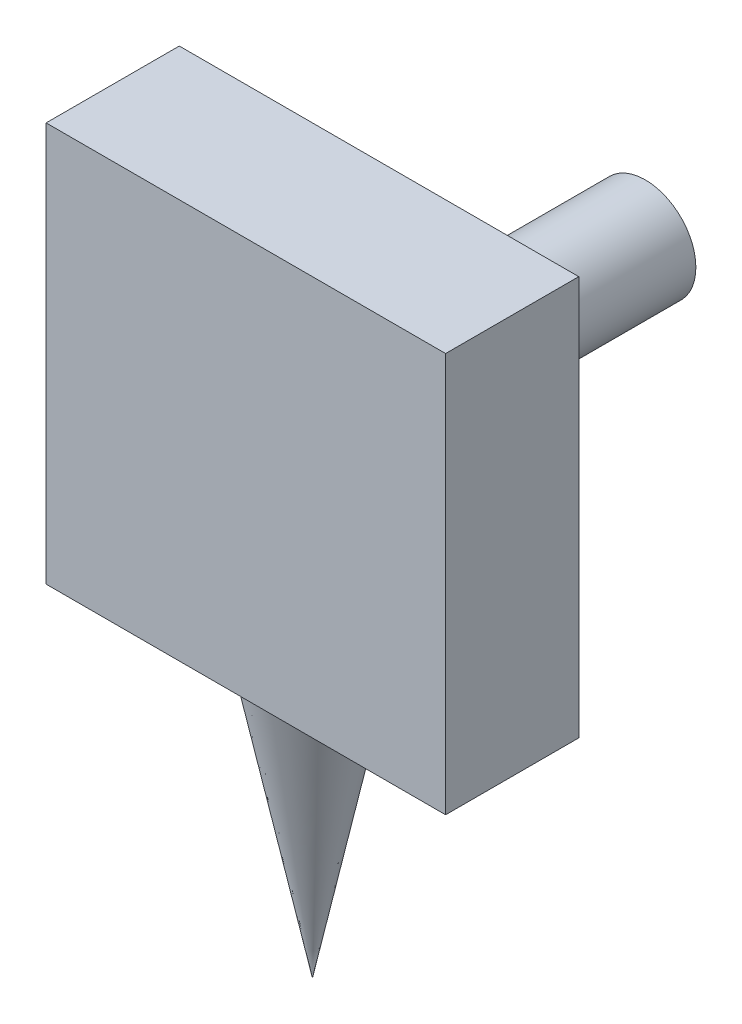
ISO-10303-21;
HEADER;
FILE_DESCRIPTION(('STEP AP214'),'2;1');
FILE_NAME('part.step','',(''),(''),'','','');
FILE_SCHEMA(('AUTOMOTIVE_DESIGN { 1 0 10303 214 1 1 1 1 }'));
ENDSEC;
DATA;
#1=APPLICATION_CONTEXT('core data for automotive mechanical design processes');
#2=APPLICATION_PROTOCOL_DEFINITION('international standard','automotive_design',2000,#1);
#3=PRODUCT_CONTEXT('',#1,'mechanical');
#4=PRODUCT('Part','Part','',(#3));
#5=PRODUCT_RELATED_PRODUCT_CATEGORY('part','',(#4));
#6=PRODUCT_DEFINITION_FORMATION('','',#4);
#7=PRODUCT_DEFINITION_CONTEXT('part definition',#1,'design');
#8=PRODUCT_DEFINITION('design','',#6,#7);
#9=PRODUCT_DEFINITION_SHAPE('','',#8);
#10=(LENGTH_UNIT() NAMED_UNIT(*) SI_UNIT(.MILLI.,.METRE.));
#11=(NAMED_UNIT(*) PLANE_ANGLE_UNIT() SI_UNIT($,.RADIAN.));
#12=(NAMED_UNIT(*) SI_UNIT($,.STERADIAN.) SOLID_ANGLE_UNIT());
#13=UNCERTAINTY_MEASURE_WITH_UNIT(LENGTH_MEASURE(1.E-05),#10,'distance_accuracy_value','');
#14=(GEOMETRIC_REPRESENTATION_CONTEXT(3) GLOBAL_UNCERTAINTY_ASSIGNED_CONTEXT((#13)) GLOBAL_UNIT_ASSIGNED_CONTEXT((#10,
#11,#12)) REPRESENTATION_CONTEXT('',''));
#15=CARTESIAN_POINT('',(0.,0.,0.));
#16=DIRECTION('',(0.,0.,1.));
#17=DIRECTION('',(1.,0.,0.));
#18=AXIS2_PLACEMENT_3D('',#15,#16,#17);
#19=CARTESIAN_POINT('',(126.972995010655,125.730606970893,-20.));
#20=DIRECTION('',(0.,0.,1.));
#21=DIRECTION('',(1.,0.,0.));
#22=AXIS2_PLACEMENT_3D('',#19,#20,#21);
#23=CYLINDRICAL_SURFACE('',#22,3.79500000000002);
#24=CARTESIAN_POINT('',(126.972995010655,125.730606970893,-20.));
#25=DIRECTION('',(0.,0.,1.));
#26=DIRECTION('',(1.,0.,0.));
#27=AXIS2_PLACEMENT_3D('',#24,#25,#26);
#28=CIRCLE('',#27,3.79500000000002);
#29=CARTESIAN_POINT('',(130.767995010655,125.730606970893,-20.));
#30=VERTEX_POINT('',#29);
#31=EDGE_CURVE('E11',#30,#30,#28,.T.);
#32=ORIENTED_EDGE('',*,*,#31,.T.);
#33=EDGE_LOOP('',(#32));
#34=FACE_BOUND('',#33,.T.);
#35=CARTESIAN_POINT('',(126.972995010655,125.730606970893,0.));
#36=DIRECTION('',(0.,0.,1.));
#37=DIRECTION('',(1.,0.,0.));
#38=AXIS2_PLACEMENT_3D('',#35,#36,#37);
#39=CIRCLE('',#38,3.79500000000002);
#40=CARTESIAN_POINT('',(130.767995010655,125.730606970893,0.));
#41=VERTEX_POINT('',#40);
#42=EDGE_CURVE('E35',#41,#41,#39,.T.);
#43=ORIENTED_EDGE('',*,*,#42,.F.);
#44=EDGE_LOOP('',(#43));
#45=FACE_BOUND('',#44,.T.);
#46=ADVANCED_FACE('F32',(#34,#45),#23,.T.);
#47=CARTESIAN_POINT('',(126.972995010655,125.730606970893,-20.));
#48=DIRECTION('',(0.,0.,1.));
#49=DIRECTION('',(1.,0.,0.));
#50=AXIS2_PLACEMENT_3D('',#47,#48,#49);
#51=PLANE('',#50);
#52=ORIENTED_EDGE('',*,*,#31,.F.);
#53=EDGE_LOOP('',(#52));
#54=FACE_BOUND('',#53,.T.);
#55=ADVANCED_FACE('F98',(#54),#51,.F.);
#56=CARTESIAN_POINT('',(141.972995010655,110.730606970893,10.));
#57=DIRECTION('',(-1.,0.,0.));
#58=DIRECTION('',(0.,0.,1.));
#59=AXIS2_PLACEMENT_3D('',#56,#57,#58);
#60=PLANE('',#59);
#61=DIRECTION('',(0.,1.,0.));
#62=VECTOR('',#61,1.);
#63=CARTESIAN_POINT('',(141.972995010655,110.730606970893,0.));
#64=LINE('',#63,#62);
#65=CARTESIAN_POINT('',(141.972995010655,110.730606970893,0.));
#66=VERTEX_POINT('',#65);
#67=CARTESIAN_POINT('',(141.972995010655,140.730606970893,0.));
#68=VERTEX_POINT('',#67);
#69=EDGE_CURVE('E125',#66,#68,#64,.T.);
#70=ORIENTED_EDGE('',*,*,#69,.T.);
#71=DIRECTION('',(0.,0.,-1.));
#72=VECTOR('',#71,1.);
#73=CARTESIAN_POINT('',(141.972995010655,140.730606970893,10.));
#74=LINE('',#73,#72);
#75=CARTESIAN_POINT('',(141.972995010655,140.730606970893,10.));
#76=VERTEX_POINT('',#75);
#77=EDGE_CURVE('E109',#76,#68,#74,.T.);
#78=ORIENTED_EDGE('',*,*,#77,.F.);
#79=DIRECTION('',(0.,1.,0.));
#80=VECTOR('',#79,1.);
#81=CARTESIAN_POINT('',(141.972995010655,110.730606970893,10.));
#82=LINE('',#81,#80);
#83=CARTESIAN_POINT('',(141.972995010655,110.730606970893,10.));
#84=VERTEX_POINT('',#83);
#85=EDGE_CURVE('E121',#84,#76,#82,.T.);
#86=ORIENTED_EDGE('',*,*,#85,.F.);
#87=DIRECTION('',(0.,0.,-1.));
#88=VECTOR('',#87,1.);
#89=CARTESIAN_POINT('',(141.972995010655,110.730606970893,10.));
#90=LINE('',#89,#88);
#91=EDGE_CURVE('E118',#84,#66,#90,.T.);
#92=ORIENTED_EDGE('',*,*,#91,.T.);
#93=EDGE_LOOP('',(#70,#78,#86,#92));
#94=FACE_BOUND('',#93,.T.);
#95=ADVANCED_FACE('F103',(#94),#60,.F.);
#96=CARTESIAN_POINT('',(111.972995010655,140.730606970893,10.));
#97=DIRECTION('',(0.,-1.,0.));
#98=DIRECTION('',(0.,0.,-1.));
#99=AXIS2_PLACEMENT_3D('',#96,#97,#98);
#100=PLANE('',#99);
#101=DIRECTION('',(-1.,0.,0.));
#102=VECTOR('',#101,1.);
#103=CARTESIAN_POINT('',(111.972995010655,140.730606970893,0.));
#104=LINE('',#103,#102);
#105=CARTESIAN_POINT('',(111.972995010655,140.730606970893,0.));
#106=VERTEX_POINT('',#105);
#107=EDGE_CURVE('E123',#68,#106,#104,.T.);
#108=ORIENTED_EDGE('',*,*,#107,.T.);
#109=DIRECTION('',(0.,0.,-1.));
#110=VECTOR('',#109,1.);
#111=CARTESIAN_POINT('',(111.972995010655,140.730606970893,10.));
#112=LINE('',#111,#110);
#113=CARTESIAN_POINT('',(111.972995010655,140.730606970893,10.));
#114=VERTEX_POINT('',#113);
#115=EDGE_CURVE('E110',#114,#106,#112,.T.);
#116=ORIENTED_EDGE('',*,*,#115,.F.);
#117=DIRECTION('',(-1.,0.,0.));
#118=VECTOR('',#117,1.);
#119=CARTESIAN_POINT('',(111.972995010655,140.730606970893,10.));
#120=LINE('',#119,#118);
#121=EDGE_CURVE('E80',#76,#114,#120,.T.);
#122=ORIENTED_EDGE('',*,*,#121,.F.);
#123=ORIENTED_EDGE('',*,*,#77,.T.);
#124=EDGE_LOOP('',(#108,#116,#122,#123));
#125=FACE_BOUND('',#124,.T.);
#126=ADVANCED_FACE('F143',(#125),#100,.F.);
#127=CARTESIAN_POINT('',(111.972995010655,110.730606970893,10.));
#128=DIRECTION('',(1.,0.,0.));
#129=DIRECTION('',(0.,0.,-1.));
#130=AXIS2_PLACEMENT_3D('',#127,#128,#129);
#131=PLANE('',#130);
#132=DIRECTION('',(0.,-1.,0.));
#133=VECTOR('',#132,1.);
#134=CARTESIAN_POINT('',(111.972995010655,110.730606970893,0.));
#135=LINE('',#134,#133);
#136=CARTESIAN_POINT('',(111.972995010655,110.730606970893,0.));
#137=VERTEX_POINT('',#136);
#138=EDGE_CURVE('E66',#106,#137,#135,.T.);
#139=ORIENTED_EDGE('',*,*,#138,.T.);
#140=DIRECTION('',(0.,0.,-1.));
#141=VECTOR('',#140,1.);
#142=CARTESIAN_POINT('',(111.972995010655,110.730606970893,10.));
#143=LINE('',#142,#141);
#144=CARTESIAN_POINT('',(111.972995010655,110.730606970893,10.));
#145=VERTEX_POINT('',#144);
#146=EDGE_CURVE('E114',#145,#137,#143,.T.);
#147=ORIENTED_EDGE('',*,*,#146,.F.);
#148=DIRECTION('',(0.,-1.,0.));
#149=VECTOR('',#148,1.);
#150=CARTESIAN_POINT('',(111.972995010655,110.730606970893,10.));
#151=LINE('',#150,#149);
#152=EDGE_CURVE('E129',#114,#145,#151,.T.);
#153=ORIENTED_EDGE('',*,*,#152,.F.);
#154=ORIENTED_EDGE('',*,*,#115,.T.);
#155=EDGE_LOOP('',(#139,#147,#153,#154));
#156=FACE_BOUND('',#155,.T.);
#157=ADVANCED_FACE('F137',(#156),#131,.F.);
#158=CARTESIAN_POINT('',(111.972995010655,110.730606970893,10.));
#159=DIRECTION('',(0.,1.,0.));
#160=DIRECTION('',(0.,0.,1.));
#161=AXIS2_PLACEMENT_3D('',#158,#159,#160);
#162=PLANE('',#161);
#163=CARTESIAN_POINT('',(126.972995010655,110.730606970893,5.));
#164=DIRECTION('',(0.,-1.,0.));
#165=DIRECTION('',(0.,0.,-1.));
#166=AXIS2_PLACEMENT_3D('',#163,#164,#165);
#167=CIRCLE('',#166,4.24147543851648);
#168=CARTESIAN_POINT('',(126.972995010655,110.730606970893,0.758524561483516));
#169=VERTEX_POINT('',#168);
#170=EDGE_CURVE('E127',#169,#169,#167,.T.);
#171=ORIENTED_EDGE('',*,*,#170,.F.);
#172=EDGE_LOOP('',(#171));
#173=FACE_BOUND('',#172,.T.);
#174=DIRECTION('',(1.,0.,0.));
#175=VECTOR('',#174,1.);
#176=CARTESIAN_POINT('',(111.972995010655,110.730606970893,0.));
#177=LINE('',#176,#175);
#178=EDGE_CURVE('E72',#137,#66,#177,.T.);
#179=ORIENTED_EDGE('',*,*,#178,.T.);
#180=ORIENTED_EDGE('',*,*,#91,.F.);
#181=DIRECTION('',(1.,0.,0.));
#182=VECTOR('',#181,1.);
#183=CARTESIAN_POINT('',(111.972995010655,110.730606970893,10.));
#184=LINE('',#183,#182);
#185=EDGE_CURVE('E48',#145,#84,#184,.T.);
#186=ORIENTED_EDGE('',*,*,#185,.F.);
#187=ORIENTED_EDGE('',*,*,#146,.T.);
#188=EDGE_LOOP('',(#179,#180,#186,#187));
#189=FACE_BOUND('',#188,.T.);
#190=ADVANCED_FACE('F135',(#173,#189),#162,.F.);
#191=CARTESIAN_POINT('',(0.,0.,10.));
#192=DIRECTION('',(0.,0.,-1.));
#193=DIRECTION('',(-1.,0.,0.));
#194=AXIS2_PLACEMENT_3D('',#191,#192,#193);
#195=PLANE('',#194);
#196=ORIENTED_EDGE('',*,*,#85,.T.);
#197=ORIENTED_EDGE('',*,*,#121,.T.);
#198=ORIENTED_EDGE('',*,*,#152,.T.);
#199=ORIENTED_EDGE('',*,*,#185,.T.);
#200=EDGE_LOOP('',(#196,#197,#198,#199));
#201=FACE_BOUND('',#200,.T.);
#202=ADVANCED_FACE('F92',(#201),#195,.F.);
#203=CARTESIAN_POINT('',(0.,0.,0.));
#204=DIRECTION('',(0.,0.,-1.));
#205=DIRECTION('',(-1.,0.,0.));
#206=AXIS2_PLACEMENT_3D('',#203,#204,#205);
#207=PLANE('',#206);
#208=ORIENTED_EDGE('',*,*,#42,.T.);
#209=EDGE_LOOP('',(#208));
#210=FACE_BOUND('',#209,.T.);
#211=ORIENTED_EDGE('',*,*,#69,.F.);
#212=ORIENTED_EDGE('',*,*,#178,.F.);
#213=ORIENTED_EDGE('',*,*,#138,.F.);
#214=ORIENTED_EDGE('',*,*,#107,.F.);
#215=EDGE_LOOP('',(#211,#212,#213,#214));
#216=FACE_BOUND('',#215,.T.);
#217=ADVANCED_FACE('F86',(#210,#216),#207,.T.);
#218=CARTESIAN_POINT('',(126.972995010655,90.1171158072049,5.));
#219=DIRECTION('',(0.,1.,0.));
#220=DIRECTION('',(0.,0.,1.));
#221=AXIS2_PLACEMENT_3D('',#218,#219,#220);
#222=CONICAL_SURFACE('',#221,0.,0.202929861223004);
#223=ORIENTED_EDGE('',*,*,#170,.T.);
#224=EDGE_LOOP('',(#223));
#225=FACE_BOUND('',#224,.T.);
#226=CARTESIAN_POINT('',(126.972995010655,90.1171158072049,5.));
#227=VERTEX_POINT('',#226);
#228=VERTEX_LOOP('',#227);
#229=FACE_BOUND('',#228,.T.);
#230=ADVANCED_FACE('F84',(#225,#229),#222,.T.);
#231=CLOSED_SHELL('',(#46,#55,#95,#126,#157,#190,#202,#217,#230));
#232=MANIFOLD_SOLID_BREP('B2',#231);
#233=ADVANCED_BREP_SHAPE_REPRESENTATION('',(#18,#232),#14);
#234=SHAPE_DEFINITION_REPRESENTATION(#9,#233);
ENDSEC;
END-ISO-10303-21;
